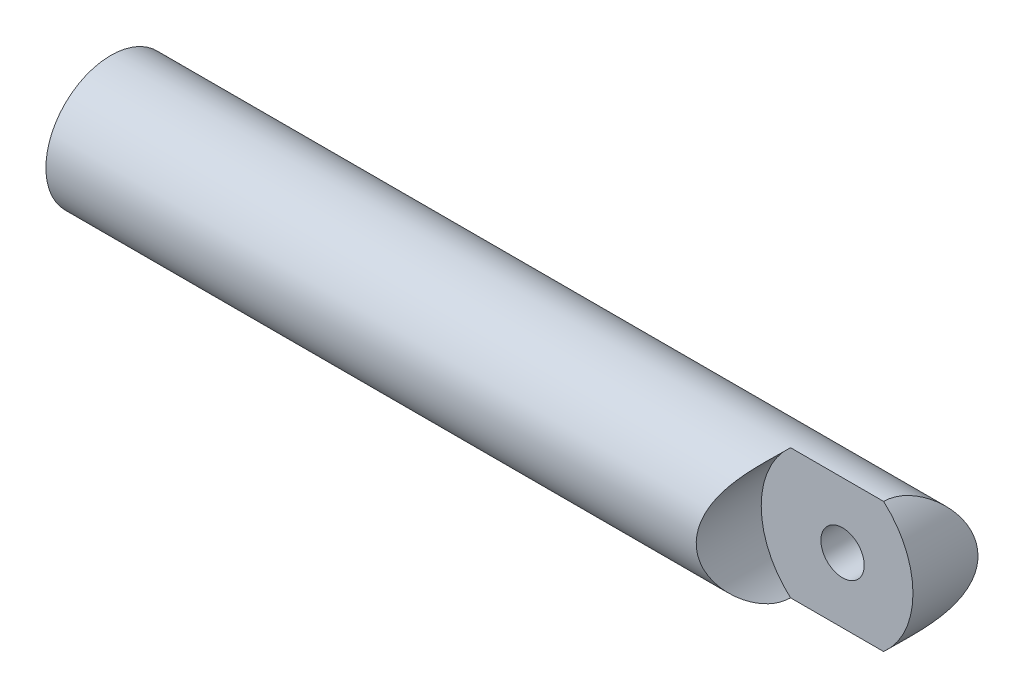
ISO-10303-21;
HEADER;
FILE_DESCRIPTION(('STEP AP214'),'2;1');
FILE_NAME('part.step','',(''),(''),'','','');
FILE_SCHEMA(('AUTOMOTIVE_DESIGN { 1 0 10303 214 1 1 1 1 }'));
ENDSEC;
DATA;
#1=APPLICATION_CONTEXT('core data for automotive mechanical design processes');
#2=APPLICATION_PROTOCOL_DEFINITION('international standard','automotive_design',2000,#1);
#3=PRODUCT_CONTEXT('',#1,'mechanical');
#4=PRODUCT('Part','Part','',(#3));
#5=PRODUCT_RELATED_PRODUCT_CATEGORY('part','',(#4));
#6=PRODUCT_DEFINITION_FORMATION('','',#4);
#7=PRODUCT_DEFINITION_CONTEXT('part definition',#1,'design');
#8=PRODUCT_DEFINITION('design','',#6,#7);
#9=PRODUCT_DEFINITION_SHAPE('','',#8);
#10=(LENGTH_UNIT() NAMED_UNIT(*) SI_UNIT(.MILLI.,.METRE.));
#11=(NAMED_UNIT(*) PLANE_ANGLE_UNIT() SI_UNIT($,.RADIAN.));
#12=(NAMED_UNIT(*) SI_UNIT($,.STERADIAN.) SOLID_ANGLE_UNIT());
#13=UNCERTAINTY_MEASURE_WITH_UNIT(LENGTH_MEASURE(1.E-05),#10,'distance_accuracy_value','');
#14=(GEOMETRIC_REPRESENTATION_CONTEXT(3) GLOBAL_UNCERTAINTY_ASSIGNED_CONTEXT((#13)) GLOBAL_UNIT_ASSIGNED_CONTEXT((#10,
#11,#12)) REPRESENTATION_CONTEXT('',''));
#15=CARTESIAN_POINT('',(0.,0.,0.));
#16=DIRECTION('',(0.,0.,1.));
#17=DIRECTION('',(1.,0.,0.));
#18=AXIS2_PLACEMENT_3D('',#15,#16,#17);
#19=CARTESIAN_POINT('',(-58.02376,0.,0.));
#20=DIRECTION('',(1.,0.,0.));
#21=DIRECTION('',(0.,0.,-1.));
#22=AXIS2_PLACEMENT_3D('',#19,#20,#21);
#23=CYLINDRICAL_SURFACE('',#22,4.70408);
#24=CARTESIAN_POINT('',(-3.52806,0.,-4.70408));
#25=CARTESIAN_POINT('',(-3.52805961153589,-0.0855132260966964,-4.70408023314863));
#26=CARTESIAN_POINT('',(-3.53508181586496,-0.171024126505788,-4.70172674044197));
#27=CARTESIAN_POINT('',(-3.56289923447879,-0.339527395282315,-4.69257002572199));
#28=CARTESIAN_POINT('',(-3.58369589332204,-0.422519498542955,-4.6857663370074));
#29=CARTESIAN_POINT('',(-3.63827035290082,-0.583531551011146,-4.66844853472646));
#30=CARTESIAN_POINT('',(-3.67202646793085,-0.661559553982138,-4.65794062201264));
#31=CARTESIAN_POINT('',(-3.75146366392858,-0.810846531575522,-4.63428703923932));
#32=CARTESIAN_POINT('',(-3.79714709325251,-0.882104169415414,-4.62114084985038));
#33=CARTESIAN_POINT('',(-3.90080221499831,-1.01829322746654,-4.5930856047475));
#34=CARTESIAN_POINT('',(-3.95911272001304,-1.08295803149603,-4.5781343557315));
#35=CARTESIAN_POINT('',(-4.08564638472096,-1.20179457004028,-4.54838634707555));
#36=CARTESIAN_POINT('',(-4.15387171840285,-1.25596399717806,-4.53358962208218));
#37=CARTESIAN_POINT('',(-4.30069789988275,-1.35379342551557,-4.50536182552034));
#38=CARTESIAN_POINT('',(-4.37954043772649,-1.39710695684101,-4.49198217361595));
#39=CARTESIAN_POINT('',(-4.54390855286389,-1.46974585322429,-4.46874489266033));
#40=CARTESIAN_POINT('',(-4.62943208397962,-1.49907548171506,-4.45888619036711));
#41=CARTESIAN_POINT('',(-4.801703037203,-1.54191403950018,-4.44425132179216));
#42=CARTESIAN_POINT('',(-4.88831224848417,-1.55592249492687,-4.43931517325869));
#43=CARTESIAN_POINT('',(-5.06278161559897,-1.56928260084737,-4.43461111063552));
#44=CARTESIAN_POINT('',(-5.15064137700285,-1.56863877467068,-4.43484160154389));
#45=CARTESIAN_POINT('',(-5.32085844288758,-1.55310047312462,-4.44030456792028));
#46=CARTESIAN_POINT('',(-5.40328386096758,-1.53885777149402,-4.4453082611095));
#47=CARTESIAN_POINT('',(-5.56450061519933,-1.49758922483042,-4.4593795065953));
#48=CARTESIAN_POINT('',(-5.64329151545094,-1.47056185084023,-4.46844754495225));
#49=CARTESIAN_POINT('',(-5.79648410963357,-1.40406419382967,-4.48978887601575));
#50=CARTESIAN_POINT('',(-5.87079477383798,-1.36440068580807,-4.50211139759993));
#51=CARTESIAN_POINT('',(-6.01191174546056,-1.27389081048716,-4.52855261807113));
#52=CARTESIAN_POINT('',(-6.07871587873728,-1.2230412158729,-4.54267183482884));
#53=CARTESIAN_POINT('',(-6.20658604063705,-1.10847171822226,-4.57201577929074));
#54=CARTESIAN_POINT('',(-6.26717117729743,-1.04421893949131,-4.58725976138209));
#55=CARTESIAN_POINT('',(-6.37683179554925,-0.90627782579026,-4.61649148216887));
#56=CARTESIAN_POINT('',(-6.42590617566787,-0.832588588880681,-4.63047910056298));
#57=CARTESIAN_POINT('',(-6.51153887345575,-0.67684717447695,-4.65580533898347));
#58=CARTESIAN_POINT('',(-6.54796846739554,-0.594719423629011,-4.66711636192977));
#59=CARTESIAN_POINT('',(-6.60634598130529,-0.425034455961636,-4.68561460939262));
#60=CARTESIAN_POINT('',(-6.62829892613458,-0.337479134613713,-4.692803264674));
#61=CARTESIAN_POINT('',(-6.65624830130884,-0.163495588754963,-4.7020098561034));
#62=CARTESIAN_POINT('',(-6.66289456134765,-0.0771827506051913,-4.70423822974185));
#63=CARTESIAN_POINT('',(-6.66189283457183,0.0953420022276377,-4.70390424518541));
#64=CARTESIAN_POINT('',(-6.65424725760925,0.181553931473021,-4.70134269465493));
#65=CARTESIAN_POINT('',(-6.62539313124523,0.348829580752197,-4.69185555954806));
#66=CARTESIAN_POINT('',(-6.60458334311021,0.429970083678787,-4.68505836569684));
#67=CARTESIAN_POINT('',(-6.55048996311853,0.587575560985785,-4.66791311126509));
#68=CARTESIAN_POINT('',(-6.51720478091768,0.664039937814626,-4.65756459798197));
#69=CARTESIAN_POINT('',(-6.43813528224049,0.812363210426065,-4.6340290421133));
#70=CARTESIAN_POINT('',(-6.39204538995794,0.884048195460184,-4.62077453157676));
#71=CARTESIAN_POINT('',(-6.28903389142025,1.01887792812312,-4.59292975925865));
#72=CARTESIAN_POINT('',(-6.23210898026603,1.08202005993001,-4.57833909062835));
#73=CARTESIAN_POINT('',(-6.10598750276117,1.20095402220738,-4.54862709414858));
#74=CARTESIAN_POINT('',(-6.03635124095651,1.25628219880687,-4.53351173618768));
#75=CARTESIAN_POINT('',(-5.88845836611098,1.3545248456967,-4.50513645712387));
#76=CARTESIAN_POINT('',(-5.81020168337337,1.3974392156103,-4.49187655102439));
#77=CARTESIAN_POINT('',(-5.64725734068644,1.46943657695893,-4.4688431603273));
#78=CARTESIAN_POINT('',(-5.56258322293971,1.49854780268987,-4.45906256913062));
#79=CARTESIAN_POINT('',(-5.38913355982139,1.54196714993696,-4.44423701018192));
#80=CARTESIAN_POINT('',(-5.30035987829921,1.55628193070599,-4.43918991218006));
#81=CARTESIAN_POINT('',(-5.12613254961542,1.56918308915234,-4.43464485034683));
#82=CARTESIAN_POINT('',(-5.0407423299488,1.56853895847779,-4.43487539366712));
#83=CARTESIAN_POINT('',(-4.87135447811416,1.55343404079124,-4.44018850343304));
#84=CARTESIAN_POINT('',(-4.78735676353487,1.5389740744196,-4.44527078169272));
#85=CARTESIAN_POINT('',(-4.62472202633187,1.49719235422084,-4.45951267996627));
#86=CARTESIAN_POINT('',(-4.54601357930887,1.4701195428232,-4.4685932032619));
#87=CARTESIAN_POINT('',(-4.39419593259397,1.40408231471101,-4.48977932022215));
#88=CARTESIAN_POINT('',(-4.32108797939794,1.36511526027167,-4.50188558478175));
#89=CARTESIAN_POINT('',(-4.17909196328963,1.27441334213095,-4.52841711496475));
#90=CARTESIAN_POINT('',(-4.11052682413319,1.22219591103314,-4.54292047088841));
#91=CARTESIAN_POINT('',(-3.98288370129038,1.10729163565847,-4.57228453792581));
#92=CARTESIAN_POINT('',(-3.92380840800554,1.04460183267014,-4.58714534901117));
#93=CARTESIAN_POINT('',(-3.81450503615089,0.907602750996228,-4.61624415412412));
#94=CARTESIAN_POINT('',(-3.76471071616034,0.832936232944635,-4.63043540543356));
#95=CARTESIAN_POINT('',(-3.67843434963355,0.675825965540429,-4.65595847066556));
#96=CARTESIAN_POINT('',(-3.64194888300324,0.593384221120051,-4.66729101898315));
#97=CARTESIAN_POINT('',(-3.58486961045802,0.4268802348221,-4.68538507393466));
#98=CARTESIAN_POINT('',(-3.56363414603158,0.343058158873487,-4.69232944644104));
#99=CARTESIAN_POINT('',(-3.53523147540845,0.172822783232454,-4.70167616587585));
#100=CARTESIAN_POINT('',(-3.52806039253884,0.08641020424953,-4.70407976440579));
#101=CARTESIAN_POINT('',(-3.52806,0.,-4.70408));
#102=B_SPLINE_CURVE_WITH_KNOTS('',3,(#24,#25,#26,#27,#28,#29,#30,#31,#32,#33,#34,#35,#36,#37,
#38,#39,#40,#41,#42,#43,#44,#45,#46,#47,#48,#49,#50,#51,#52,#53,#54,#55,#56,#57,#58,#59,#60,#61,
#62,#63,#64,#65,#66,#67,#68,#69,#70,#71,#72,#73,#74,#75,#76,#77,#78,#79,#80,#81,#82,#83,#84,#85,
#86,#87,#88,#89,#90,#91,#92,#93,#94,#95,#96,#97,#98,#99,#100,#101),.UNSPECIFIED.,.T.,.F.,(4,2,2,
2,2,2,2,2,2,2,2,2,2,2,2,2,2,2,2,2,2,2,2,2,2,2,2,2,2,2,2,2,2,2,2,2,2,2,4),(0.,0.25622169831295,
0.512470271435582,0.768291906930138,1.02416394890792,1.2880161855916,1.55192636373805,
1.82341523109485,2.09482127351229,2.35708724599346,2.61927225502188,2.86949053534685,
3.11973874759262,3.37401379220227,3.62836229453328,3.89597442628201,4.16361215559613,
4.43389959628097,4.70409317047516,4.96258597931599,5.2210352057094,5.47200776269133,
5.72301232415925,5.98061530725171,6.23829699072729,6.50767356516502,6.77705231769271,
7.04587765388283,7.31458195043247,7.56949612678059,7.82439516254198,8.07446350142183,
8.32458733700476,8.58561565686495,8.84671784897909,9.11798096767194,9.38917432828418,
9.64815502051687,9.90706431788507),.UNSPECIFIED.);
#103=CARTESIAN_POINT('',(-3.52806,0.,-4.70408));
#104=VERTEX_POINT('',#103);
#105=EDGE_CURVE('E71',#104,#104,#102,.T.);
#106=ORIENTED_EDGE('',*,*,#105,.F.);
#107=EDGE_LOOP('',(#106));
#108=FACE_BOUND('',#107,.T.);
#109=CARTESIAN_POINT('',(-58.02376,0.,0.));
#110=DIRECTION('',(1.,0.,0.));
#111=DIRECTION('',(0.,0.,-1.));
#112=AXIS2_PLACEMENT_3D('',#109,#110,#111);
#113=CIRCLE('',#112,4.70408);
#114=CARTESIAN_POINT('',(-58.02376,0.,-4.70408));
#115=VERTEX_POINT('',#114);
#116=EDGE_CURVE('E75',#115,#115,#113,.T.);
#117=ORIENTED_EDGE('',*,*,#116,.T.);
#118=EDGE_LOOP('',(#117));
#119=FACE_BOUND('',#118,.T.);
#120=DIRECTION('',(1.,0.,0.));
#121=VECTOR('',#120,1.);
#122=CARTESIAN_POINT('',(-58.02376,-4.70408,0.));
#123=LINE('',#122,#121);
#124=CARTESIAN_POINT('',(-2.12263175556567,-4.70408,0.));
#125=VERTEX_POINT('',#124);
#126=CARTESIAN_POINT('',(-8.85524824443433,-4.70408,0.));
#127=VERTEX_POINT('',#126);
#128=EDGE_CURVE('E52',#125,#127,#123,.F.);
#129=ORIENTED_EDGE('',*,*,#128,.T.);
#130=CARTESIAN_POINT('',(-8.85524824443433,-4.70408,0.));
#131=CARTESIAN_POINT('',(-8.85515885309911,-4.70411644237083,0.110882922762079));
#132=CARTESIAN_POINT('',(-8.85968868486633,-4.70016138949824,0.221706344675235));
#133=CARTESIAN_POINT('',(-8.87728694089215,-4.6845653299634,0.441904558502865));
#134=CARTESIAN_POINT('',(-8.89033759682134,-4.67294031680845,0.551281882769168));
#135=CARTESIAN_POINT('',(-8.92406554725186,-4.6424954200915,0.766342016523592));
#136=CARTESIAN_POINT('',(-8.94464300136798,-4.62376961192896,0.872054204531141));
#137=CARTESIAN_POINT('',(-8.99237925808136,-4.57953274778084,1.0805594954028));
#138=CARTESIAN_POINT('',(-9.01954121355405,-4.55401844066638,1.18335117340861));
#139=CARTESIAN_POINT('',(-9.0790509554596,-4.49687404066316,1.38468709168209));
#140=CARTESIAN_POINT('',(-9.11135489986476,-4.46529522311589,1.48325901712979));
#141=CARTESIAN_POINT('',(-9.18018992506336,-4.3962926604705,1.67676230678945));
#142=CARTESIAN_POINT('',(-9.21672058432907,-4.35886949809541,1.77169403278124));
#143=CARTESIAN_POINT('',(-9.33139625703249,-4.23801960934424,2.05157729227626));
#144=CARTESIAN_POINT('',(-9.41442803123928,-4.14619325830801,2.23099245817985));
#145=CARTESIAN_POINT('',(-9.55237995754816,-3.98259824644853,2.50635686376451));
#146=CARTESIAN_POINT('',(-9.60541611221043,-3.91728027060266,2.60723046560527));
#147=CARTESIAN_POINT('',(-9.71249605646182,-3.77941237741565,2.80335146870629));
#148=CARTESIAN_POINT('',(-9.76653993527764,-3.70686181718566,2.89859836862059));
#149=CARTESIAN_POINT('',(-9.92856856102676,-3.47851024144816,3.17579379032412));
#150=CARTESIAN_POINT('',(-10.0364676370547,-3.31198952518253,3.34923027294112));
#151=CARTESIAN_POINT('',(-10.2027397592035,-3.02341907370723,3.60672247487657));
#152=CARTESIAN_POINT('',(-10.2637574667459,-2.90998696172426,3.69891208610035));
#153=CARTESIAN_POINT('',(-10.3813003154728,-2.67341647882141,3.8733452128031));
#154=CARTESIAN_POINT('',(-10.43782439801,-2.55027583421041,3.95558638690921));
#155=CARTESIAN_POINT('',(-10.5446975817179,-2.29497034567287,4.10896965138803));
#156=CARTESIAN_POINT('',(-10.5950544499674,-2.16281718589491,4.18012573387641));
#157=CARTESIAN_POINT('',(-10.6881173093079,-1.89012760934061,4.31028727762672));
#158=CARTESIAN_POINT('',(-10.7308276603104,-1.74959603112209,4.3692996658992));
#159=CARTESIAN_POINT('',(-10.7956426103033,-1.50475894848464,4.45820129849059));
#160=CARTESIAN_POINT('',(-10.820078434896,-1.4022959354389,4.4915081398393));
#161=CARTESIAN_POINT('',(-10.8640597449369,-1.19436066362049,4.55121540434566));
#162=CARTESIAN_POINT('',(-10.8836064460212,-1.08888916016204,4.57761754436917));
#163=CARTESIAN_POINT('',(-10.9173798396333,-0.875830288263357,4.62310808757628));
#164=CARTESIAN_POINT('',(-10.931619911499,-0.768248970833911,4.64221488717155));
#165=CARTESIAN_POINT('',(-10.9545445726805,-0.551474433813352,4.67292358371531));
#166=CARTESIAN_POINT('',(-10.9632321682299,-0.442282119272486,4.68452954182379));
#167=CARTESIAN_POINT('',(-10.9719899447237,-0.277387940767155,4.69622218369035));
#168=CARTESIAN_POINT('',(-10.9741970725084,-0.221981925018806,4.6991671670887));
#169=CARTESIAN_POINT('',(-10.9771424811612,-0.111053275230035,4.70309650402609));
#170=CARTESIAN_POINT('',(-10.9778805359932,-0.0555306245592259,4.70408055585026));
#171=CARTESIAN_POINT('',(-10.977878891272,0.114867787403056,4.7040788501968));
#172=CARTESIAN_POINT('',(-10.9747174316583,0.229769694218995,4.69986466980976));
#173=CARTESIAN_POINT('',(-10.962142407693,0.458667747591608,4.68307348883353));
#174=CARTESIAN_POINT('',(-10.9527248802102,0.572663273615225,4.67049118715086));
#175=CARTESIAN_POINT('',(-10.9278350360197,0.79901678075782,4.63713839707189));
#176=CARTESIAN_POINT('',(-10.9123505110682,0.911370983309634,4.6163513982441));
#177=CARTESIAN_POINT('',(-10.8756749721203,1.13342641125001,4.56690936288654));
#178=CARTESIAN_POINT('',(-10.8544814012786,1.24312642388791,4.53825080089631));
#179=CARTESIAN_POINT('',(-10.8070028665696,1.45841216017905,4.47369485193369));
#180=CARTESIAN_POINT('',(-10.7807525450135,1.56402031709664,4.4378466539726));
#181=CARTESIAN_POINT('',(-10.7235877595741,1.77134889992032,4.35924302293084));
#182=CARTESIAN_POINT('',(-10.6926714502714,1.87306776755538,4.31648485645062));
#183=CARTESIAN_POINT('',(-10.5938070838125,2.17151822375697,4.17861458015182));
#184=CARTESIAN_POINT('',(-10.5196771010572,2.36183457717964,4.07381780083637));
#185=CARTESIAN_POINT('',(-10.3523144518085,2.7394577707648,3.8312885267581));
#186=CARTESIAN_POINT('',(-10.2579484942601,2.92485380396861,3.69140471808745));
#187=CARTESIAN_POINT('',(-10.0612608485681,3.27121494365863,3.38829914786665));
#188=CARTESIAN_POINT('',(-9.95892682668878,3.43214098888686,3.22504086377984));
#189=CARTESIAN_POINT('',(-9.79413222335645,3.66929774097302,2.94677518116266));
#190=CARTESIAN_POINT('',(-9.73201645858594,3.75374134595123,2.83843319756461));
#191=CARTESIAN_POINT('',(-9.60895704089411,3.91316687971877,2.61427189702527));
#192=CARTESIAN_POINT('',(-9.54801375322011,3.98814589931576,2.49845029748098));
#193=CARTESIAN_POINT('',(-9.42923598562494,4.12818253994358,2.25956265722312));
#194=CARTESIAN_POINT('',(-9.37139905205624,4.19324806835087,2.13650250001849));
#195=CARTESIAN_POINT('',(-9.26103178263865,4.31293164609699,1.88324640142944));
#196=CARTESIAN_POINT('',(-9.20849829209436,4.36755592378519,1.75305477407737));
#197=CARTESIAN_POINT('',(-9.09546413680768,4.4815950634699,1.44195739202834));
#198=CARTESIAN_POINT('',(-9.03792442929259,4.53679548786481,1.25832290058211));
#199=CARTESIAN_POINT('',(-8.96734883036008,4.60284068961899,0.975491731051713));
#200=CARTESIAN_POINT('',(-8.94646442187721,4.62204780926939,0.880124768114105));
#201=CARTESIAN_POINT('',(-8.91069695296044,4.65462409058605,0.687304038364043));
#202=CARTESIAN_POINT('',(-8.89581068882946,4.66799636904406,0.589851414904962));
#203=CARTESIAN_POINT('',(-8.87471473575351,4.68684804447137,0.410474695768999));
#204=CARTESIAN_POINT('',(-8.86745083210603,4.69329148520817,0.328774132084971));
#205=CARTESIAN_POINT('',(-8.85769965410468,4.70191659644485,0.164723385798445));
#206=CARTESIAN_POINT('',(-8.85522073543323,4.70409081201133,0.082372318516781));
#207=CARTESIAN_POINT('',(-8.85524824443432,4.70408,0.));
#208=B_SPLINE_CURVE_WITH_KNOTS('',3,(#130,#131,#132,#133,#134,#135,#136,#137,#138,#139,#140,
#141,#142,#143,#144,#145,#146,#147,#148,#149,#150,#151,#152,#153,#154,#155,#156,#157,#158,#159,
#160,#161,#162,#163,#164,#165,#166,#167,#168,#169,#170,#171,#172,#173,#174,#175,#176,#177,#178,
#179,#180,#181,#182,#183,#184,#185,#186,#187,#188,#189,#190,#191,#192,#193,#194,#195,#196,#197,
#198,#199,#200,#201,#202,#203,#204,#205,#206,#207),.UNSPECIFIED.,.F.,.F.,(4,2,2,2,2,2,2,2,2,2,2,
2,2,2,2,2,2,2,2,2,2,2,2,2,2,2,2,2,2,2,2,2,2,2,2,2,2,2,4),(0.,0.332391161969427,0.66409139859552,
0.991542489218374,1.31915068496128,1.64410206908458,1.96902107388983,2.62087927209222,
3.01467974564512,3.40851525453882,4.19606011161032,4.67070353380339,5.14545844727102,
5.61960916094749,6.09348865505945,6.4245910619068,6.75561106112477,7.08579073723004,
7.41579149496544,7.58232850436316,7.74889113567136,8.09343400862243,8.43819535306142,
8.78365403205314,9.12926768565486,9.47259283040493,9.81605411937646,10.5020528363772,
11.2515787817772,12.0022889053996,12.4541382956237,12.9061262373293,13.3577517473493,
13.8091070100335,14.4071775380884,14.705370922773,15.0034048261895,15.2499887302276,
15.4970028382206),.UNSPECIFIED.);
#209=CARTESIAN_POINT('',(-8.85524824443433,4.70408,0.));
#210=VERTEX_POINT('',#209);
#211=EDGE_CURVE('E11',#127,#210,#208,.T.);
#212=ORIENTED_EDGE('',*,*,#211,.T.);
#213=DIRECTION('',(1.,0.,0.));
#214=VECTOR('',#213,1.);
#215=CARTESIAN_POINT('',(-58.02376,4.70408,0.));
#216=LINE('',#215,#214);
#217=CARTESIAN_POINT('',(-2.12263175556567,4.70408,0.));
#218=VERTEX_POINT('',#217);
#219=EDGE_CURVE('E61',#210,#218,#216,.T.);
#220=ORIENTED_EDGE('',*,*,#219,.T.);
#221=CARTESIAN_POINT('',(0.,0.,-4.70408));
#222=CARTESIAN_POINT('',(-1.09899473940623E-06,0.114879470042861,-4.70407886113321));
#223=CARTESIAN_POINT('',(-0.00316305225596261,0.229788100527686,-4.69986402463672));
#224=CARTESIAN_POINT('',(-0.0157397971089255,0.458698269533405,-4.68307054386394));
#225=CARTESIAN_POINT('',(-0.0251583463240836,0.572699221251487,-4.67048687337855));
#226=CARTESIAN_POINT('',(-0.0500494461271544,0.799050923582596,-4.63713238107445));
#227=CARTESIAN_POINT('',(-0.0655335821364891,0.911398086784833,-4.61634589110221));
#228=CARTESIAN_POINT('',(-0.102207610185438,1.1334397230326,-4.56690587083508));
#229=CARTESIAN_POINT('',(-0.123400049538158,1.24313298790957,-4.53824882821744));
#230=CARTESIAN_POINT('',(-0.170876590052783,1.45840971073586,-4.47369559077918));
#231=CARTESIAN_POINT('',(-0.197126249666776,1.56401547224401,-4.43784829990509));
#232=CARTESIAN_POINT('',(-0.2542895064108,1.77133945819231,-4.35924679366452));
#233=CARTESIAN_POINT('',(-0.285204948493548,1.87305612476838,-4.31648984559254));
#234=CARTESIAN_POINT('',(-0.384069503282093,2.17150945658324,-4.17861940644736));
#235=CARTESIAN_POINT('',(-0.45820105869129,2.36183042375631,-4.07382046667601));
#236=CARTESIAN_POINT('',(-0.625566439924086,2.73945978414282,-3.83128723552483));
#237=CARTESIAN_POINT('',(-0.719933429865833,2.92485758265105,-3.6914018717025));
#238=CARTESIAN_POINT('',(-0.916621231606451,3.27121821546097,-3.38829582255785));
#239=CARTESIAN_POINT('',(-1.01895421834446,3.43214249104451,-3.22503908463843));
#240=CARTESIAN_POINT('',(-1.18375405132081,3.66930677194946,-2.9467645947417));
#241=CARTESIAN_POINT('',(-1.24587613086682,3.75375846438954,-2.83841126474304));
#242=CARTESIAN_POINT('',(-1.36894743011217,3.91319777446247,-2.61422631909696));
#243=CARTESIAN_POINT('',(-1.42989629163496,3.98818253955138,-2.4983924652584));
#244=CARTESIAN_POINT('',(-1.54867178907194,4.12821406819305,-2.25950420518408));
#245=CARTESIAN_POINT('',(-1.60650151315421,4.19327078250069,-2.1364572021488));
#246=CARTESIAN_POINT('',(-1.71685725700344,4.31294103601434,-1.88322376354166));
#247=CARTESIAN_POINT('',(-1.76938628770814,4.36756051978906,-1.75304144661869));
#248=CARTESIAN_POINT('',(-1.88177347297337,4.48094699393865,-1.44372635375338));
#249=CARTESIAN_POINT('',(-1.93880582115345,4.53569217769908,-1.26199236939332));
#250=CARTESIAN_POINT('',(-2.00902494843062,4.60144423790798,-0.981976177367653));
#251=CARTESIAN_POINT('',(-2.02986897018472,4.62062774731915,-0.887457061619678));
#252=CARTESIAN_POINT('',(-2.06567495198121,4.65326107153342,-0.696355040678762));
#253=CARTESIAN_POINT('',(-2.08063994197376,4.66671384016249,-0.599773225698808));
#254=CARTESIAN_POINT('',(-2.10413457498111,4.68771910792377,-0.404248514807088));
#255=CARTESIAN_POINT('',(-2.11260207149459,4.69521465175156,-0.305291931992136));
#256=CARTESIAN_POINT('',(-2.12244309201876,4.70391817333583,-0.106747777328195));
#257=CARTESIAN_POINT('',(-2.12381680960304,4.70512632266144,-0.00716022277128434));
#258=CARTESIAN_POINT('',(-2.11939458487666,4.701222365811,0.191765032001641));
#259=CARTESIAN_POINT('',(-2.11359628172847,4.69610817849102,0.291102639153835));
#260=CARTESIAN_POINT('',(-2.09513571141569,4.67968758160716,0.488595027189468));
#261=CARTESIAN_POINT('',(-2.08247337382968,4.66838110851366,0.586749795927041));
#262=CARTESIAN_POINT('',(-2.03844004793268,4.6285823574109,0.857494470354466));
#263=CARTESIAN_POINT('',(-2.00018525789176,4.59356638069661,1.02805508889263));
#264=CARTESIAN_POINT('',(-1.90835715164984,4.5063759042661,1.36035970169106));
#265=CARTESIAN_POINT('',(-1.85476913501527,4.45418493111295,1.52209505686594));
#266=CARTESIAN_POINT('',(-1.74819700739978,4.34558964425011,1.80633211507968));
#267=CARTESIAN_POINT('',(-1.69697033904771,4.29179396100012,1.93051866193184));
#268=CARTESIAN_POINT('',(-1.58987146726211,4.17464705280057,2.1722671178021));
#269=CARTESIAN_POINT('',(-1.53399689000476,4.11129093144044,2.28982558960441));
#270=CARTESIAN_POINT('',(-1.41943733585855,3.97538013285013,2.51842001115798));
#271=CARTESIAN_POINT('',(-1.36074676783059,3.90280664093689,2.62944192014667));
#272=CARTESIAN_POINT('',(-1.24231642075089,3.74888946959293,2.84458961228521));
#273=CARTESIAN_POINT('',(-1.18257680730037,3.66754716416288,2.94871647171679));
#274=CARTESIAN_POINT('',(-1.0619806344037,3.49412765183512,3.15242267459845));
#275=CARTESIAN_POINT('',(-1.00113353927465,3.40183273075138,3.25182298652471));
#276=CARTESIAN_POINT('',(-0.881240294658795,3.20840301501496,3.44282099110599));
#277=CARTESIAN_POINT('',(-0.822194867217674,3.107264737425,3.53441558119441));
#278=CARTESIAN_POINT('',(-0.650020035865313,2.79122944864577,3.7963253085217));
#279=CARTESIAN_POINT('',(-0.541477610456696,2.56319478174815,3.95437776220065));
#280=CARTESIAN_POINT('',(-0.366876764094348,2.1243428692321,4.20305298834253));
#281=CARTESIAN_POINT('',(-0.296663953504053,1.91925598125668,4.30084249683081));
#282=CARTESIAN_POINT('',(-0.206163872947254,1.59897336844724,4.42547325845479));
#283=CARTESIAN_POINT('',(-0.178461763713149,1.49007383758067,4.46334823645532));
#284=CARTESIAN_POINT('',(-0.128562358770412,1.26865194871492,4.53125607033628));
#285=CARTESIAN_POINT('',(-0.106362689547272,1.1561311765106,4.56129230780703));
#286=CARTESIAN_POINT('',(-0.067836239484817,0.927426435861854,4.61325198037322));
#287=CARTESIAN_POINT('',(-0.0515497439243759,0.811222995896407,4.63511979363859));
#288=CARTESIAN_POINT('',(-0.0254620397610563,0.5768315077408,4.67008193905025));
#289=CARTESIAN_POINT('',(-0.0156578833023457,0.458644386740723,4.68318025917414));
#290=CARTESIAN_POINT('',(-0.00277642962040202,0.221262190498588,4.70037992000558));
#291=CARTESIAN_POINT('',(0.000301562222352799,0.102067220614738,4.70448218974679));
#292=CARTESIAN_POINT('',(-0.000348161254173439,-0.13626385709263,4.70361566134637));
#293=CARTESIAN_POINT('',(-0.00407534185359926,-0.255399968805204,4.69864757591249));
#294=CARTESIAN_POINT('',(-0.0175230925226121,-0.480598569339742,4.68068739508596));
#295=CARTESIAN_POINT('',(-0.0266020924909211,-0.58676908411314,4.66855401793463));
#296=CARTESIAN_POINT('',(-0.0499875976007648,-0.797487981733636,4.63721338582918));
#297=CARTESIAN_POINT('',(-0.0642957561135045,-0.902035840613341,4.61800389351227));
#298=CARTESIAN_POINT('',(-0.114665364797188,-1.21216710419739,4.55013096461436));
#299=CARTESIAN_POINT('',(-0.158183090867209,-1.41441396193009,4.49120852189515));
#300=CARTESIAN_POINT('',(-0.26378036529669,-1.81223508522197,4.34634050874127));
#301=CARTESIAN_POINT('',(-0.32646355324026,-2.00731821980275,4.25951055611592));
#302=CARTESIAN_POINT('',(-0.465609892684265,-2.38014815663529,4.06296584156022));
#303=CARTESIAN_POINT('',(-0.54207494787467,-2.55789255865299,3.95324791778336));
#304=CARTESIAN_POINT('',(-0.718060171566248,-2.92265297492477,3.69386267475786));
#305=CARTESIAN_POINT('',(-0.819297887851819,-3.10625777359466,3.54058356762629));
#306=CARTESIAN_POINT('',(-1.02797117040315,-3.44699970320184,3.20984542078334));
#307=CARTESIAN_POINT('',(-1.13542017167269,-3.60407634118289,3.03233274255613));
#308=CARTESIAN_POINT('',(-1.30536103967365,-3.83229620339976,2.7316105195825));
#309=CARTESIAN_POINT('',(-1.3684516128318,-3.91249306260002,2.61549198817042));
#310=CARTESIAN_POINT('',(-1.49212427966008,-4.06270785660918,2.3754643222539));
#311=CARTESIAN_POINT('',(-1.55270544562055,-4.13272205056114,2.25155234846036));
#312=CARTESIAN_POINT('',(-1.66893405146242,-4.26184324369918,1.99635870109728));
#313=CARTESIAN_POINT('',(-1.7245929761017,-4.32097600039333,1.86509541612608));
#314=CARTESIAN_POINT('',(-1.8284115048623,-4.42771059940564,1.59524522291418));
#315=CARTESIAN_POINT('',(-1.87657732489505,-4.47532201767263,1.45666451407181));
#316=CARTESIAN_POINT('',(-1.97184804811372,-4.56717867579618,1.14096596985531));
#317=CARTESIAN_POINT('',(-2.01636432242858,-4.60835274489,0.962101577646953));
#318=CARTESIAN_POINT('',(-2.06689415413305,-4.65435415070867,0.688428740110842));
#319=CARTESIAN_POINT('',(-2.0810267404918,-4.66705871708381,0.596359677717011));
#320=CARTESIAN_POINT('',(-2.10335431070479,-4.68702245536968,0.410933734931876));
#321=CARTESIAN_POINT('',(-2.11155193522566,-4.69428404909513,0.317577446136402));
#322=CARTESIAN_POINT('',(-2.12166903807813,-4.70323515349886,0.129756547316395));
#323=CARTESIAN_POINT('',(-2.12355475034197,-4.70489469596623,0.035288680844716));
#324=CARTESIAN_POINT('',(-2.12086751071043,-4.70252286709315,-0.153480812036183));
#325=CARTESIAN_POINT('',(-2.11629469313128,-4.69849161410258,-0.247782441861743));
#326=CARTESIAN_POINT('',(-2.10089551432393,-4.68482008516649,-0.435544822263522));
#327=CARTESIAN_POINT('',(-2.09006336560288,-4.67517461815509,-0.529004713221316));
#328=CARTESIAN_POINT('',(-2.06261025428675,-4.6504608475269,-0.714376866700607));
#329=CARTESIAN_POINT('',(-2.04598629640077,-4.63538973785127,-0.806288302589218));
#330=CARTESIAN_POINT('',(-2.00339756624556,-4.59622012741159,-1.00789553127367));
#331=CARTESIAN_POINT('',(-1.97618504397422,-4.57086814429958,-1.11708431370555));
#332=CARTESIAN_POINT('',(-1.91544644299483,-4.51298978393153,-1.33179292820957));
#333=CARTESIAN_POINT('',(-1.88191559865086,-4.48045798806207,-1.43730991917397));
#334=CARTESIAN_POINT('',(-1.80982462397533,-4.4086372057546,-1.64448521887478));
#335=CARTESIAN_POINT('',(-1.77125457325536,-4.36933484055929,-1.74613539172924));
#336=CARTESIAN_POINT('',(-1.69039342442193,-4.2844355501174,-1.94516960940008));
#337=CARTESIAN_POINT('',(-1.64810346378526,-4.23884054662862,-2.04255494477236));
#338=CARTESIAN_POINT('',(-1.54578116853294,-4.1248177764662,-2.26604899725751));
#339=CARTESIAN_POINT('',(-1.4846758734861,-4.05395068408558,-2.39042696787529));
#340=CARTESIAN_POINT('',(-1.35997135222535,-3.90186311666055,-2.63137563260445));
#341=CARTESIAN_POINT('',(-1.29637135567399,-3.82063942590282,-2.74794388458417));
#342=CARTESIAN_POINT('',(-1.16856874168223,-3.64811114268747,-2.97317834237723));
#343=CARTESIAN_POINT('',(-1.10436570843756,-3.55679904282792,-3.08183856223853));
#344=CARTESIAN_POINT('',(-0.977117467233582,-3.36437602939745,-3.2908225935279));
#345=CARTESIAN_POINT('',(-0.914072119938703,-3.26326630435638,-3.3911474133706));
#346=CARTESIAN_POINT('',(-0.790189716160386,-3.05055062858303,-3.58374983889349));
#347=CARTESIAN_POINT('',(-0.729375323499771,-2.93886454680213,-3.67595376574392));
#348=CARTESIAN_POINT('',(-0.612055241368645,-2.70595895365416,-3.85062860828933));
#349=CARTESIAN_POINT('',(-0.555550115169062,-2.5847382001876,-3.93309825237009));
#350=CARTESIAN_POINT('',(-0.448493205158759,-2.33344896743767,-4.0871828933268));
#351=CARTESIAN_POINT('',(-0.397930183634878,-2.2033979479788,-4.15881845576053));
#352=CARTESIAN_POINT('',(-0.304157126895581,-1.93497068116763,-4.29028680462967));
#353=CARTESIAN_POINT('',(-0.260943293909618,-1.79659878406568,-4.3501256896832));
#354=CARTESIAN_POINT('',(-0.194680483355411,-1.55425591221123,-4.44118914703655));
#355=CARTESIAN_POINT('',(-0.169433860744877,-1.45209172928846,-4.47565961234101));
#356=CARTESIAN_POINT('',(-0.123784853115037,-1.24464797980977,-4.53772318941537));
#357=CARTESIAN_POINT('',(-0.103381291575662,-1.13936917688883,-4.56531797156938));
#358=CARTESIAN_POINT('',(-0.0678611308532294,-0.926554096060898,-4.61321326672012));
#359=CARTESIAN_POINT('',(-0.0527322822675735,-0.81902367161823,-4.63353068289965));
#360=CARTESIAN_POINT('',(-0.0280185855588239,-0.602221728148417,-4.66665942854588));
#361=CARTESIAN_POINT('',(-0.0184308902941297,-0.492951132962883,-4.67947461283452));
#362=CARTESIAN_POINT('',(-0.00781905678052828,-0.319564734320725,-4.69364782406693));
#363=CARTESIAN_POINT('',(-0.00488949680085937,-0.255758997918503,-4.69755725482395));
#364=CARTESIAN_POINT('',(-0.000979507126661114,-0.127971874487306,-4.70277386718447));
#365=CARTESIAN_POINT('',(6.12164907320017E-07,-0.06399046110972,-4.70408063437454));
#366=CARTESIAN_POINT('',(0.,0.,-4.70408));
#367=B_SPLINE_CURVE_WITH_KNOTS('',3,(#221,#222,#223,#224,#225,#226,#227,#228,#229,#230,#231,
#232,#233,#234,#235,#236,#237,#238,#239,#240,#241,#242,#243,#244,#245,#246,#247,#248,#249,#250,
#251,#252,#253,#254,#255,#256,#257,#258,#259,#260,#261,#262,#263,#264,#265,#266,#267,#268,#269,
#270,#271,#272,#273,#274,#275,#276,#277,#278,#279,#280,#281,#282,#283,#284,#285,#286,#287,#288,
#289,#290,#291,#292,#293,#294,#295,#296,#297,#298,#299,#300,#301,#302,#303,#304,#305,#306,#307,
#308,#309,#310,#311,#312,#313,#314,#315,#316,#317,#318,#319,#320,#321,#322,#323,#324,#325,#326,
#327,#328,#329,#330,#331,#332,#333,#334,#335,#336,#337,#338,#339,#340,#341,#342,#343,#344,#345,
#346,#347,#348,#349,#350,#351,#352,#353,#354,#355,#356,#357,#358,#359,#360,#361,#362,#363,#364,
#365,#366),.UNSPECIFIED.,.T.,.F.,(4,2,2,2,2,2,2,2,2,2,2,2,2,2,2,2,2,2,2,2,2,2,2,2,2,2,2,2,2,2,2,
2,2,2,2,2,2,2,2,2,2,2,2,2,2,2,2,2,2,2,2,2,2,2,2,2,2,2,2,2,2,2,2,2,2,2,2,2,2,2,2,2,4),(0.,
0.344569303160462,0.689345737117672,1.0347839389744,1.38037654770367,1.72369381495801,
2.06714719481025,2.75316166724397,3.50269522963098,4.25339773445335,4.70529291732802,
5.15732394046317,5.60889888037458,6.06021585223644,6.65232788258857,6.94804997543227,
7.24361945770405,7.54198189830054,7.84033619720055,8.13878873250201,8.43724432982858,
8.96989555555583,9.50305917129032,9.93661851287763,10.3704006617403,10.8050829312477,
11.2396971883612,11.685188576881,12.1308562184312,13.0195698953998,13.729912208447,
14.085268112182,14.4404704629445,14.7980492374653,15.1554652903237,15.51284443063,
15.8701954908986,16.191548564382,16.5130033322837,17.1553891779963,17.8205605454742,
18.4858238636176,19.2622188350014,20.0403610137917,20.5036404796118,20.9670897151337,
21.4294273948789,21.8913794730131,22.4554580798807,22.7371927238377,23.0188019372913,
23.3019152539206,23.5850226828087,23.8683922978493,24.1519086783311,24.4974345645981,
24.8432221168527,25.1897009574077,25.536074217281,26.0023862040467,26.4688433344129,
26.9356499523201,27.4024000135948,27.8730229265943,28.343707250386,28.8134865805249,
29.2830224046851,29.6149121216943,29.946721130355,30.2777543685657,30.6086173645367,
30.8005197001971,30.9924525893832),.UNSPECIFIED.);
#368=EDGE_CURVE('E73',#125,#218,#367,.T.);
#369=ORIENTED_EDGE('',*,*,#368,.F.);
#370=EDGE_LOOP('',(#129,#212,#220,#369));
#371=FACE_BOUND('',#370,.T.);
#372=ADVANCED_FACE('F32',(#108,#119,#371),#23,.T.);
#373=CARTESIAN_POINT('',(-6.2738,0.,-4.70408));
#374=DIRECTION('',(0.,0.,1.));
#375=DIRECTION('',(1.,0.,0.));
#376=AXIS2_PLACEMENT_3D('',#373,#374,#375);
#377=CYLINDRICAL_SURFACE('',#376,6.2738);
#378=CARTESIAN_POINT('',(-6.2738,0.,0.));
#379=DIRECTION('',(0.,0.,1.));
#380=DIRECTION('',(1.,0.,0.));
#381=AXIS2_PLACEMENT_3D('',#378,#379,#380);
#382=CIRCLE('',#381,6.2738);
#383=EDGE_CURVE('E45',#125,#218,#382,.T.);
#384=ORIENTED_EDGE('',*,*,#383,.F.);
#385=ORIENTED_EDGE('',*,*,#368,.T.);
#386=EDGE_LOOP('',(#384,#385));
#387=FACE_BOUND('',#386,.T.);
#388=ADVANCED_FACE('F82',(#387),#377,.T.);
#389=CARTESIAN_POINT('',(-58.02376,0.,0.));
#390=DIRECTION('',(1.,0.,0.));
#391=DIRECTION('',(0.,0.,-1.));
#392=AXIS2_PLACEMENT_3D('',#389,#390,#391);
#393=PLANE('',#392);
#394=ORIENTED_EDGE('',*,*,#116,.F.);
#395=EDGE_LOOP('',(#394));
#396=FACE_BOUND('',#395,.T.);
#397=ADVANCED_FACE('F85',(#396),#393,.F.);
#398=CARTESIAN_POINT('',(-4.70408,0.,4.70408));
#399=DIRECTION('',(0.,0.,-1.));
#400=DIRECTION('',(-1.,0.,0.));
#401=AXIS2_PLACEMENT_3D('',#398,#399,#400);
#402=CYLINDRICAL_SURFACE('',#401,6.2738);
#403=ORIENTED_EDGE('',*,*,#211,.F.);
#404=CARTESIAN_POINT('',(-4.70408,0.,0.));
#405=DIRECTION('',(0.,0.,1.));
#406=DIRECTION('',(1.,0.,0.));
#407=AXIS2_PLACEMENT_3D('',#404,#405,#406);
#408=CIRCLE('',#407,6.2738);
#409=EDGE_CURVE('E64',#210,#127,#408,.T.);
#410=ORIENTED_EDGE('',*,*,#409,.F.);
#411=EDGE_LOOP('',(#403,#410));
#412=FACE_BOUND('',#411,.T.);
#413=ADVANCED_FACE('F70',(#412),#402,.F.);
#414=CARTESIAN_POINT('',(-4.70408,0.,0.));
#415=DIRECTION('',(0.,0.,1.));
#416=DIRECTION('',(1.,0.,0.));
#417=AXIS2_PLACEMENT_3D('',#414,#415,#416);
#418=PLANE('',#417);
#419=CARTESIAN_POINT('',(-5.09524,0.,0.));
#420=DIRECTION('',(0.,0.,1.));
#421=DIRECTION('',(1.,0.,0.));
#422=AXIS2_PLACEMENT_3D('',#419,#420,#421);
#423=CIRCLE('',#422,1.56718);
#424=CARTESIAN_POINT('',(-3.52806,0.,0.));
#425=VERTEX_POINT('',#424);
#426=EDGE_CURVE('E104',#425,#425,#423,.T.);
#427=ORIENTED_EDGE('',*,*,#426,.F.);
#428=EDGE_LOOP('',(#427));
#429=FACE_BOUND('',#428,.T.);
#430=ORIENTED_EDGE('',*,*,#383,.T.);
#431=ORIENTED_EDGE('',*,*,#219,.F.);
#432=ORIENTED_EDGE('',*,*,#409,.T.);
#433=ORIENTED_EDGE('',*,*,#128,.F.);
#434=EDGE_LOOP('',(#430,#431,#432,#433));
#435=FACE_BOUND('',#434,.T.);
#436=ADVANCED_FACE('F63',(#429,#435),#418,.T.);
#437=CARTESIAN_POINT('',(-5.09524,0.,-4.70408));
#438=DIRECTION('',(0.,0.,1.));
#439=DIRECTION('',(1.,0.,0.));
#440=AXIS2_PLACEMENT_3D('',#437,#438,#439);
#441=CYLINDRICAL_SURFACE('',#440,1.56718);
#442=ORIENTED_EDGE('',*,*,#105,.T.);
#443=EDGE_LOOP('',(#442));
#444=FACE_BOUND('',#443,.T.);
#445=ORIENTED_EDGE('',*,*,#426,.T.);
#446=EDGE_LOOP('',(#445));
#447=FACE_BOUND('',#446,.T.);
#448=ADVANCED_FACE('F112',(#444,#447),#441,.F.);
#449=CLOSED_SHELL('',(#372,#388,#397,#413,#436,#448));
#450=MANIFOLD_SOLID_BREP('B2',#449);
#451=ADVANCED_BREP_SHAPE_REPRESENTATION('',(#18,#450),#14);
#452=SHAPE_DEFINITION_REPRESENTATION(#9,#451);
ENDSEC;
END-ISO-10303-21;
